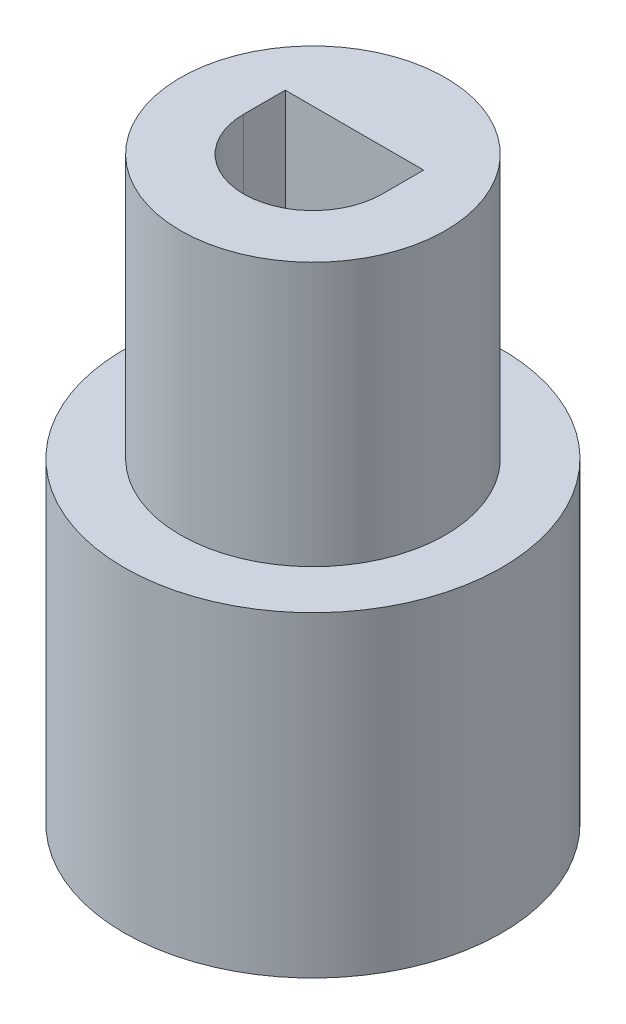
ISO-10303-21;
HEADER;
FILE_DESCRIPTION(('STEP AP214'),'2;1');
FILE_NAME('part.step','',(''),(''),'','','');
FILE_SCHEMA(('AUTOMOTIVE_DESIGN { 1 0 10303 214 1 1 1 1 }'));
ENDSEC;
DATA;
#1=APPLICATION_CONTEXT('core data for automotive mechanical design processes');
#2=APPLICATION_PROTOCOL_DEFINITION('international standard','automotive_design',2000,#1);
#3=PRODUCT_CONTEXT('',#1,'mechanical');
#4=PRODUCT('Part','Part','',(#3));
#5=PRODUCT_RELATED_PRODUCT_CATEGORY('part','',(#4));
#6=PRODUCT_DEFINITION_FORMATION('','',#4);
#7=PRODUCT_DEFINITION_CONTEXT('part definition',#1,'design');
#8=PRODUCT_DEFINITION('design','',#6,#7);
#9=PRODUCT_DEFINITION_SHAPE('','',#8);
#10=(LENGTH_UNIT() NAMED_UNIT(*) SI_UNIT(.MILLI.,.METRE.));
#11=(NAMED_UNIT(*) PLANE_ANGLE_UNIT() SI_UNIT($,.RADIAN.));
#12=(NAMED_UNIT(*) SI_UNIT($,.STERADIAN.) SOLID_ANGLE_UNIT());
#13=UNCERTAINTY_MEASURE_WITH_UNIT(LENGTH_MEASURE(1.E-05),#10,'distance_accuracy_value','');
#14=(GEOMETRIC_REPRESENTATION_CONTEXT(3) GLOBAL_UNCERTAINTY_ASSIGNED_CONTEXT((#13)) GLOBAL_UNIT_ASSIGNED_CONTEXT((#10,
#11,#12)) REPRESENTATION_CONTEXT('',''));
#15=CARTESIAN_POINT('',(0.,0.,0.));
#16=DIRECTION('',(0.,0.,1.));
#17=DIRECTION('',(1.,0.,0.));
#18=AXIS2_PLACEMENT_3D('',#15,#16,#17);
#19=CARTESIAN_POINT('',(0.,12.,0.));
#20=DIRECTION('',(0.,1.,0.));
#21=DIRECTION('',(0.,0.,1.));
#22=AXIS2_PLACEMENT_3D('',#19,#20,#21);
#23=PLANE('',#22);
#24=CARTESIAN_POINT('',(0.,12.,0.));
#25=DIRECTION('',(0.,1.,0.));
#26=DIRECTION('',(0.,0.,1.));
#27=AXIS2_PLACEMENT_3D('',#24,#25,#26);
#28=CIRCLE('',#27,7.1625);
#29=CARTESIAN_POINT('',(0.,12.,7.1625));
#30=VERTEX_POINT('',#29);
#31=EDGE_CURVE('E117',#30,#30,#28,.T.);
#32=ORIENTED_EDGE('',*,*,#31,.T.);
#33=EDGE_LOOP('',(#32));
#34=FACE_BOUND('',#33,.T.);
#35=CARTESIAN_POINT('',(0.,12.,0.));
#36=DIRECTION('',(0.,1.,0.));
#37=DIRECTION('',(0.,0.,1.));
#38=AXIS2_PLACEMENT_3D('',#35,#36,#37);
#39=CIRCLE('',#38,5.025);
#40=CARTESIAN_POINT('',(0.,12.,5.025));
#41=VERTEX_POINT('',#40);
#42=EDGE_CURVE('E92',#41,#41,#39,.T.);
#43=ORIENTED_EDGE('',*,*,#42,.F.);
#44=EDGE_LOOP('',(#43));
#45=FACE_BOUND('',#44,.T.);
#46=ADVANCED_FACE('F37',(#34,#45),#23,.T.);
#47=CARTESIAN_POINT('',(0.,10.,0.));
#48=DIRECTION('',(0.,-1.,0.));
#49=DIRECTION('',(0.,0.,-1.));
#50=AXIS2_PLACEMENT_3D('',#47,#48,#49);
#51=CYLINDRICAL_SURFACE('',#50,4.7625);
#52=CARTESIAN_POINT('',(0.,10.,0.));
#53=DIRECTION('',(0.,1.,0.));
#54=DIRECTION('',(0.,0.,1.));
#55=AXIS2_PLACEMENT_3D('',#52,#53,#54);
#56=CIRCLE('',#55,4.7625);
#57=CARTESIAN_POINT('',(0.,10.,4.7625));
#58=VERTEX_POINT('',#57);
#59=EDGE_CURVE('E122',#58,#58,#56,.T.);
#60=ORIENTED_EDGE('',*,*,#59,.T.);
#61=EDGE_LOOP('',(#60));
#62=FACE_BOUND('',#61,.T.);
#63=CARTESIAN_POINT('',(0.,0.,0.));
#64=DIRECTION('',(0.,1.,0.));
#65=DIRECTION('',(0.,0.,1.));
#66=AXIS2_PLACEMENT_3D('',#63,#64,#65);
#67=CIRCLE('',#66,4.7625);
#68=CARTESIAN_POINT('',(0.,0.,4.7625));
#69=VERTEX_POINT('',#68);
#70=EDGE_CURVE('E45',#69,#69,#67,.T.);
#71=ORIENTED_EDGE('',*,*,#70,.F.);
#72=EDGE_LOOP('',(#71));
#73=FACE_BOUND('',#72,.T.);
#74=ADVANCED_FACE('F39',(#62,#73),#51,.F.);
#75=CARTESIAN_POINT('',(0.,10.,0.));
#76=DIRECTION('',(0.,-1.,0.));
#77=DIRECTION('',(0.,0.,-1.));
#78=AXIS2_PLACEMENT_3D('',#75,#76,#77);
#79=CYLINDRICAL_SURFACE('',#78,7.1625);
#80=CARTESIAN_POINT('',(0.,0.,0.));
#81=DIRECTION('',(0.,1.,0.));
#82=DIRECTION('',(0.,0.,1.));
#83=AXIS2_PLACEMENT_3D('',#80,#81,#82);
#84=CIRCLE('',#83,7.1625);
#85=CARTESIAN_POINT('',(0.,0.,7.1625));
#86=VERTEX_POINT('',#85);
#87=EDGE_CURVE('E11',#86,#86,#84,.T.);
#88=ORIENTED_EDGE('',*,*,#87,.T.);
#89=EDGE_LOOP('',(#88));
#90=FACE_BOUND('',#89,.T.);
#91=ORIENTED_EDGE('',*,*,#31,.F.);
#92=EDGE_LOOP('',(#91));
#93=FACE_BOUND('',#92,.T.);
#94=ADVANCED_FACE('F131',(#90,#93),#79,.T.);
#95=CARTESIAN_POINT('',(0.,0.,0.));
#96=DIRECTION('',(0.,1.,0.));
#97=DIRECTION('',(0.,0.,1.));
#98=AXIS2_PLACEMENT_3D('',#95,#96,#97);
#99=PLANE('',#98);
#100=ORIENTED_EDGE('',*,*,#70,.T.);
#101=EDGE_LOOP('',(#100));
#102=FACE_BOUND('',#101,.T.);
#103=ORIENTED_EDGE('',*,*,#87,.F.);
#104=EDGE_LOOP('',(#103));
#105=FACE_BOUND('',#104,.T.);
#106=ADVANCED_FACE('F127',(#102,#105),#99,.F.);
#107=CARTESIAN_POINT('',(0.,10.,0.));
#108=DIRECTION('',(0.,1.,0.));
#109=DIRECTION('',(0.,0.,1.));
#110=AXIS2_PLACEMENT_3D('',#107,#108,#109);
#111=PLANE('',#110);
#112=ORIENTED_EDGE('',*,*,#59,.F.);
#113=EDGE_LOOP('',(#112));
#114=FACE_BOUND('',#113,.T.);
#115=ADVANCED_FACE('F143',(#114),#111,.F.);
#116=CARTESIAN_POINT('',(0.,22.,0.));
#117=DIRECTION('',(0.,1.,0.));
#118=DIRECTION('',(0.,0.,1.));
#119=AXIS2_PLACEMENT_3D('',#116,#117,#118);
#120=PLANE('',#119);
#121=CARTESIAN_POINT('',(0.,22.,0.));
#122=DIRECTION('',(0.,1.,0.));
#123=DIRECTION('',(0.,0.,1.));
#124=AXIS2_PLACEMENT_3D('',#121,#122,#123);
#125=CIRCLE('',#124,5.025);
#126=CARTESIAN_POINT('',(0.,22.,5.025));
#127=VERTEX_POINT('',#126);
#128=EDGE_CURVE('E114',#127,#127,#125,.T.);
#129=ORIENTED_EDGE('',*,*,#128,.T.);
#130=EDGE_LOOP('',(#129));
#131=FACE_BOUND('',#130,.T.);
#132=DIRECTION('',(0.,0.,-1.));
#133=VECTOR('',#132,1.);
#134=CARTESIAN_POINT('',(2.625,22.,-1.575));
#135=LINE('',#134,#133);
#136=CARTESIAN_POINT('',(2.625,22.,0.));
#137=VERTEX_POINT('',#136);
#138=CARTESIAN_POINT('',(2.625,22.,-1.575));
#139=VERTEX_POINT('',#138);
#140=EDGE_CURVE('E86',#137,#139,#135,.T.);
#141=ORIENTED_EDGE('',*,*,#140,.F.);
#142=CARTESIAN_POINT('',(0.,22.,0.));
#143=DIRECTION('',(0.,1.,0.));
#144=DIRECTION('',(0.,0.,1.));
#145=AXIS2_PLACEMENT_3D('',#142,#143,#144);
#146=CIRCLE('',#145,2.625);
#147=CARTESIAN_POINT('',(-2.625,22.,0.));
#148=VERTEX_POINT('',#147);
#149=EDGE_CURVE('E77',#148,#137,#146,.T.);
#150=ORIENTED_EDGE('',*,*,#149,.F.);
#151=DIRECTION('',(0.,0.,1.));
#152=VECTOR('',#151,1.);
#153=CARTESIAN_POINT('',(-2.625,22.,0.));
#154=LINE('',#153,#152);
#155=CARTESIAN_POINT('',(-2.625,22.,-1.575));
#156=VERTEX_POINT('',#155);
#157=EDGE_CURVE('E100',#156,#148,#154,.T.);
#158=ORIENTED_EDGE('',*,*,#157,.F.);
#159=DIRECTION('',(-1.,0.,0.));
#160=VECTOR('',#159,1.);
#161=CARTESIAN_POINT('',(-2.625,22.,-1.575));
#162=LINE('',#161,#160);
#163=EDGE_CURVE('E98',#139,#156,#162,.T.);
#164=ORIENTED_EDGE('',*,*,#163,.F.);
#165=EDGE_LOOP('',(#141,#150,#158,#164));
#166=FACE_BOUND('',#165,.T.);
#167=ADVANCED_FACE('F96',(#131,#166),#120,.T.);
#168=CARTESIAN_POINT('',(0.,22.,0.));
#169=DIRECTION('',(0.,-1.,0.));
#170=DIRECTION('',(0.,0.,-1.));
#171=AXIS2_PLACEMENT_3D('',#168,#169,#170);
#172=CYLINDRICAL_SURFACE('',#171,5.025);
#173=ORIENTED_EDGE('',*,*,#128,.F.);
#174=EDGE_LOOP('',(#173));
#175=FACE_BOUND('',#174,.T.);
#176=ORIENTED_EDGE('',*,*,#42,.T.);
#177=EDGE_LOOP('',(#176));
#178=FACE_BOUND('',#177,.T.);
#179=ADVANCED_FACE('F150',(#175,#178),#172,.T.);
#180=CARTESIAN_POINT('',(0.,22.,0.));
#181=DIRECTION('',(0.,-1.,0.));
#182=DIRECTION('',(0.,0.,-1.));
#183=AXIS2_PLACEMENT_3D('',#180,#181,#182);
#184=CYLINDRICAL_SURFACE('',#183,2.625);
#185=CARTESIAN_POINT('',(0.,12.,0.));
#186=DIRECTION('',(0.,1.,0.));
#187=DIRECTION('',(0.,0.,1.));
#188=AXIS2_PLACEMENT_3D('',#185,#186,#187);
#189=CIRCLE('',#188,2.625);
#190=CARTESIAN_POINT('',(-2.625,12.,0.));
#191=VERTEX_POINT('',#190);
#192=CARTESIAN_POINT('',(2.625,12.,0.));
#193=VERTEX_POINT('',#192);
#194=EDGE_CURVE('E52',#191,#193,#189,.T.);
#195=ORIENTED_EDGE('',*,*,#194,.F.);
#196=DIRECTION('',(0.,-1.,0.));
#197=VECTOR('',#196,1.);
#198=CARTESIAN_POINT('',(-2.625,22.,0.));
#199=LINE('',#198,#197);
#200=EDGE_CURVE('E82',#148,#191,#199,.T.);
#201=ORIENTED_EDGE('',*,*,#200,.F.);
#202=ORIENTED_EDGE('',*,*,#149,.T.);
#203=DIRECTION('',(0.,-1.,0.));
#204=VECTOR('',#203,1.);
#205=CARTESIAN_POINT('',(2.625,22.,0.));
#206=LINE('',#205,#204);
#207=EDGE_CURVE('E80',#137,#193,#206,.T.);
#208=ORIENTED_EDGE('',*,*,#207,.T.);
#209=EDGE_LOOP('',(#195,#201,#202,#208));
#210=FACE_BOUND('',#209,.T.);
#211=ADVANCED_FACE('F79',(#210),#184,.F.);
#212=CARTESIAN_POINT('',(2.625,22.,-1.575));
#213=DIRECTION('',(-1.,0.,0.));
#214=DIRECTION('',(0.,0.,1.));
#215=AXIS2_PLACEMENT_3D('',#212,#213,#214);
#216=PLANE('',#215);
#217=DIRECTION('',(0.,0.,-1.));
#218=VECTOR('',#217,1.);
#219=CARTESIAN_POINT('',(2.625,12.,-1.575));
#220=LINE('',#219,#218);
#221=CARTESIAN_POINT('',(2.625,12.,-1.575));
#222=VERTEX_POINT('',#221);
#223=EDGE_CURVE('E56',#193,#222,#220,.T.);
#224=ORIENTED_EDGE('',*,*,#223,.F.);
#225=ORIENTED_EDGE('',*,*,#207,.F.);
#226=ORIENTED_EDGE('',*,*,#140,.T.);
#227=DIRECTION('',(0.,-1.,0.));
#228=VECTOR('',#227,1.);
#229=CARTESIAN_POINT('',(2.625,22.,-1.575));
#230=LINE('',#229,#228);
#231=EDGE_CURVE('E93',#139,#222,#230,.T.);
#232=ORIENTED_EDGE('',*,*,#231,.T.);
#233=EDGE_LOOP('',(#224,#225,#226,#232));
#234=FACE_BOUND('',#233,.T.);
#235=ADVANCED_FACE('F90',(#234),#216,.T.);
#236=CARTESIAN_POINT('',(-2.625,22.,-1.575));
#237=DIRECTION('',(0.,0.,1.));
#238=DIRECTION('',(1.,0.,0.));
#239=AXIS2_PLACEMENT_3D('',#236,#237,#238);
#240=PLANE('',#239);
#241=DIRECTION('',(-1.,0.,0.));
#242=VECTOR('',#241,1.);
#243=CARTESIAN_POINT('',(-2.625,12.,-1.575));
#244=LINE('',#243,#242);
#245=CARTESIAN_POINT('',(-2.625,12.,-1.575));
#246=VERTEX_POINT('',#245);
#247=EDGE_CURVE('E106',#222,#246,#244,.T.);
#248=ORIENTED_EDGE('',*,*,#247,.F.);
#249=ORIENTED_EDGE('',*,*,#231,.F.);
#250=ORIENTED_EDGE('',*,*,#163,.T.);
#251=DIRECTION('',(0.,-1.,0.));
#252=VECTOR('',#251,1.);
#253=CARTESIAN_POINT('',(-2.625,22.,-1.575));
#254=LINE('',#253,#252);
#255=EDGE_CURVE('E110',#156,#246,#254,.T.);
#256=ORIENTED_EDGE('',*,*,#255,.T.);
#257=EDGE_LOOP('',(#248,#249,#250,#256));
#258=FACE_BOUND('',#257,.T.);
#259=ADVANCED_FACE('F164',(#258),#240,.T.);
#260=CARTESIAN_POINT('',(-2.625,22.,0.));
#261=DIRECTION('',(1.,0.,0.));
#262=DIRECTION('',(0.,0.,-1.));
#263=AXIS2_PLACEMENT_3D('',#260,#261,#262);
#264=PLANE('',#263);
#265=DIRECTION('',(0.,0.,1.));
#266=VECTOR('',#265,1.);
#267=CARTESIAN_POINT('',(-2.625,12.,0.));
#268=LINE('',#267,#266);
#269=EDGE_CURVE('E87',#246,#191,#268,.T.);
#270=ORIENTED_EDGE('',*,*,#269,.F.);
#271=ORIENTED_EDGE('',*,*,#255,.F.);
#272=ORIENTED_EDGE('',*,*,#157,.T.);
#273=ORIENTED_EDGE('',*,*,#200,.T.);
#274=EDGE_LOOP('',(#270,#271,#272,#273));
#275=FACE_BOUND('',#274,.T.);
#276=ADVANCED_FACE('F156',(#275),#264,.T.);
#277=ORIENTED_EDGE('',*,*,#194,.T.);
#278=ORIENTED_EDGE('',*,*,#223,.T.);
#279=ORIENTED_EDGE('',*,*,#247,.T.);
#280=ORIENTED_EDGE('',*,*,#269,.T.);
#281=EDGE_LOOP('',(#277,#278,#279,#280));
#282=FACE_BOUND('',#281,.T.);
#283=ADVANCED_FACE('F140',(#282),#23,.T.);
#284=CLOSED_SHELL('',(#46,#74,#94,#106,#115,#167,#179,#211,#235,#259,#276,#283));
#285=MANIFOLD_SOLID_BREP('B2',#284);
#286=ADVANCED_BREP_SHAPE_REPRESENTATION('',(#18,#285),#14);
#287=SHAPE_DEFINITION_REPRESENTATION(#9,#286);
ENDSEC;
END-ISO-10303-21;
